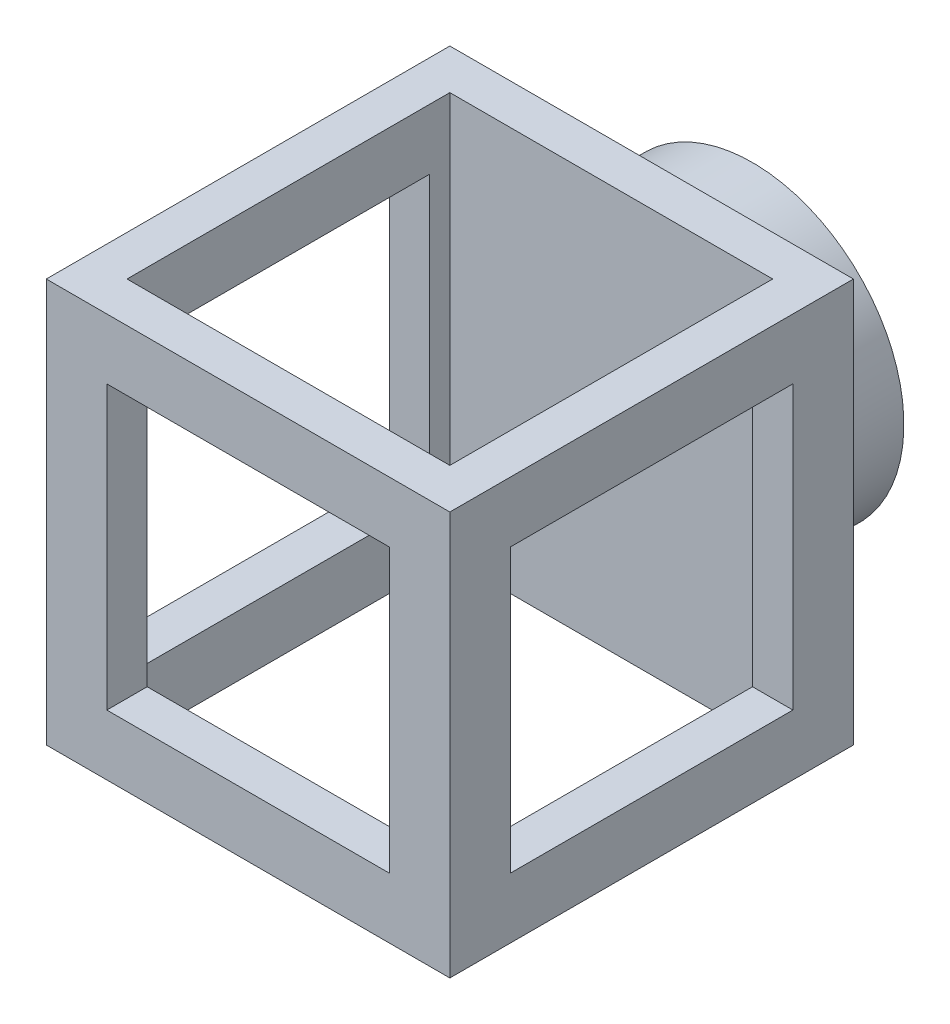
ISO-10303-21;
HEADER;
FILE_DESCRIPTION(('STEP AP214'),'2;1');
FILE_NAME('part.step','',(''),(''),'','','');
FILE_SCHEMA(('AUTOMOTIVE_DESIGN { 1 0 10303 214 1 1 1 1 }'));
ENDSEC;
DATA;
#1=APPLICATION_CONTEXT('core data for automotive mechanical design processes');
#2=APPLICATION_PROTOCOL_DEFINITION('international standard','automotive_design',2000,#1);
#3=PRODUCT_CONTEXT('',#1,'mechanical');
#4=PRODUCT('Part','Part','',(#3));
#5=PRODUCT_RELATED_PRODUCT_CATEGORY('part','',(#4));
#6=PRODUCT_DEFINITION_FORMATION('','',#4);
#7=PRODUCT_DEFINITION_CONTEXT('part definition',#1,'design');
#8=PRODUCT_DEFINITION('design','',#6,#7);
#9=PRODUCT_DEFINITION_SHAPE('','',#8);
#10=(LENGTH_UNIT() NAMED_UNIT(*) SI_UNIT(.MILLI.,.METRE.));
#11=(NAMED_UNIT(*) PLANE_ANGLE_UNIT() SI_UNIT($,.RADIAN.));
#12=(NAMED_UNIT(*) SI_UNIT($,.STERADIAN.) SOLID_ANGLE_UNIT());
#13=UNCERTAINTY_MEASURE_WITH_UNIT(LENGTH_MEASURE(1.E-05),#10,'distance_accuracy_value','');
#14=(GEOMETRIC_REPRESENTATION_CONTEXT(3) GLOBAL_UNCERTAINTY_ASSIGNED_CONTEXT((#13)) GLOBAL_UNIT_ASSIGNED_CONTEXT((#10,
#11,#12)) REPRESENTATION_CONTEXT('',''));
#15=CARTESIAN_POINT('',(0.,0.,0.));
#16=DIRECTION('',(0.,0.,1.));
#17=DIRECTION('',(1.,0.,0.));
#18=AXIS2_PLACEMENT_3D('',#15,#16,#17);
#19=CARTESIAN_POINT('',(0.,10.,0.));
#20=DIRECTION('',(0.,1.,0.));
#21=DIRECTION('',(0.,0.,1.));
#22=AXIS2_PLACEMENT_3D('',#19,#20,#21);
#23=PLANE('',#22);
#24=DIRECTION('',(0.,0.,-1.));
#25=VECTOR('',#24,1.);
#26=CARTESIAN_POINT('',(9.99999999999999,10.,-10.));
#27=LINE('',#26,#25);
#28=CARTESIAN_POINT('',(10.,10.,10.));
#29=VERTEX_POINT('',#28);
#30=CARTESIAN_POINT('',(9.99999999999999,10.,-10.));
#31=VERTEX_POINT('',#30);
#32=EDGE_CURVE('E292',#29,#31,#27,.T.);
#33=ORIENTED_EDGE('',*,*,#32,.T.);
#34=DIRECTION('',(-1.,0.,0.));
#35=VECTOR('',#34,1.);
#36=CARTESIAN_POINT('',(-10.,10.,-10.));
#37=LINE('',#36,#35);
#38=CARTESIAN_POINT('',(-10.,10.,-10.));
#39=VERTEX_POINT('',#38);
#40=EDGE_CURVE('E295',#31,#39,#37,.T.);
#41=ORIENTED_EDGE('',*,*,#40,.T.);
#42=DIRECTION('',(0.,0.,1.));
#43=VECTOR('',#42,1.);
#44=CARTESIAN_POINT('',(-10.,10.,-10.));
#45=LINE('',#44,#43);
#46=CARTESIAN_POINT('',(-10.,10.,10.));
#47=VERTEX_POINT('',#46);
#48=EDGE_CURVE('E298',#39,#47,#45,.T.);
#49=ORIENTED_EDGE('',*,*,#48,.T.);
#50=DIRECTION('',(1.,0.,0.));
#51=VECTOR('',#50,1.);
#52=CARTESIAN_POINT('',(-10.,10.,10.));
#53=LINE('',#52,#51);
#54=EDGE_CURVE('E300',#47,#29,#53,.T.);
#55=ORIENTED_EDGE('',*,*,#54,.T.);
#56=EDGE_LOOP('',(#33,#41,#49,#55));
#57=FACE_BOUND('',#56,.T.);
#58=DIRECTION('',(1.,0.,0.));
#59=VECTOR('',#58,1.);
#60=CARTESIAN_POINT('',(-8.00000000000001,10.,8.));
#61=LINE('',#60,#59);
#62=CARTESIAN_POINT('',(-8.00000000000001,10.,8.));
#63=VERTEX_POINT('',#62);
#64=CARTESIAN_POINT('',(7.99999999999999,10.,8.));
#65=VERTEX_POINT('',#64);
#66=EDGE_CURVE('E263',#63,#65,#61,.T.);
#67=ORIENTED_EDGE('',*,*,#66,.F.);
#68=DIRECTION('',(0.,0.,1.));
#69=VECTOR('',#68,1.);
#70=CARTESIAN_POINT('',(-8.00000000000001,10.,-8.));
#71=LINE('',#70,#69);
#72=CARTESIAN_POINT('',(-8.00000000000001,10.,-8.));
#73=VERTEX_POINT('',#72);
#74=EDGE_CURVE('E261',#73,#63,#71,.T.);
#75=ORIENTED_EDGE('',*,*,#74,.F.);
#76=DIRECTION('',(-1.,0.,0.));
#77=VECTOR('',#76,1.);
#78=CARTESIAN_POINT('',(-8.00000000000001,10.,-8.));
#79=LINE('',#78,#77);
#80=CARTESIAN_POINT('',(7.99999999999999,10.,-8.));
#81=VERTEX_POINT('',#80);
#82=EDGE_CURVE('E269',#81,#73,#79,.T.);
#83=ORIENTED_EDGE('',*,*,#82,.F.);
#84=DIRECTION('',(0.,0.,-1.));
#85=VECTOR('',#84,1.);
#86=CARTESIAN_POINT('',(7.99999999999999,10.,-8.));
#87=LINE('',#86,#85);
#88=EDGE_CURVE('E266',#65,#81,#87,.T.);
#89=ORIENTED_EDGE('',*,*,#88,.F.);
#90=EDGE_LOOP('',(#67,#75,#83,#89));
#91=FACE_BOUND('',#90,.T.);
#92=ADVANCED_FACE('F36',(#57,#91),#23,.T.);
#93=CARTESIAN_POINT('',(0.,-10.,0.));
#94=DIRECTION('',(0.,1.,0.));
#95=DIRECTION('',(0.,0.,1.));
#96=AXIS2_PLACEMENT_3D('',#93,#94,#95);
#97=PLANE('',#96);
#98=DIRECTION('',(0.,0.,-1.));
#99=VECTOR('',#98,1.);
#100=CARTESIAN_POINT('',(9.99999999999999,-10.,-10.));
#101=LINE('',#100,#99);
#102=CARTESIAN_POINT('',(10.,-10.,10.));
#103=VERTEX_POINT('',#102);
#104=CARTESIAN_POINT('',(9.99999999999999,-10.,-10.));
#105=VERTEX_POINT('',#104);
#106=EDGE_CURVE('E291',#103,#105,#101,.T.);
#107=ORIENTED_EDGE('',*,*,#106,.F.);
#108=DIRECTION('',(1.,0.,0.));
#109=VECTOR('',#108,1.);
#110=CARTESIAN_POINT('',(-10.,-10.,10.));
#111=LINE('',#110,#109);
#112=CARTESIAN_POINT('',(-10.,-10.,10.));
#113=VERTEX_POINT('',#112);
#114=EDGE_CURVE('E296',#113,#103,#111,.T.);
#115=ORIENTED_EDGE('',*,*,#114,.F.);
#116=DIRECTION('',(0.,0.,1.));
#117=VECTOR('',#116,1.);
#118=CARTESIAN_POINT('',(-10.,-10.,-10.));
#119=LINE('',#118,#117);
#120=CARTESIAN_POINT('',(-10.,-10.,-10.));
#121=VERTEX_POINT('',#120);
#122=EDGE_CURVE('E307',#121,#113,#119,.T.);
#123=ORIENTED_EDGE('',*,*,#122,.F.);
#124=DIRECTION('',(-1.,0.,0.));
#125=VECTOR('',#124,1.);
#126=CARTESIAN_POINT('',(-10.,-10.,-10.));
#127=LINE('',#126,#125);
#128=EDGE_CURVE('E305',#105,#121,#127,.T.);
#129=ORIENTED_EDGE('',*,*,#128,.F.);
#130=EDGE_LOOP('',(#107,#115,#123,#129));
#131=FACE_BOUND('',#130,.T.);
#132=DIRECTION('',(0.,0.,1.));
#133=VECTOR('',#132,1.);
#134=CARTESIAN_POINT('',(-8.00000000000001,-10.,-8.));
#135=LINE('',#134,#133);
#136=CARTESIAN_POINT('',(-8.00000000000001,-10.,-8.));
#137=VERTEX_POINT('',#136);
#138=CARTESIAN_POINT('',(-8.00000000000001,-10.,8.));
#139=VERTEX_POINT('',#138);
#140=EDGE_CURVE('E260',#137,#139,#135,.T.);
#141=ORIENTED_EDGE('',*,*,#140,.T.);
#142=DIRECTION('',(1.,0.,0.));
#143=VECTOR('',#142,1.);
#144=CARTESIAN_POINT('',(-8.00000000000001,-10.,8.));
#145=LINE('',#144,#143);
#146=CARTESIAN_POINT('',(7.99999999999999,-10.,8.));
#147=VERTEX_POINT('',#146);
#148=EDGE_CURVE('E274',#139,#147,#145,.T.);
#149=ORIENTED_EDGE('',*,*,#148,.T.);
#150=DIRECTION('',(0.,0.,-1.));
#151=VECTOR('',#150,1.);
#152=CARTESIAN_POINT('',(7.99999999999999,-10.,-8.));
#153=LINE('',#152,#151);
#154=CARTESIAN_POINT('',(7.99999999999999,-10.,-8.));
#155=VERTEX_POINT('',#154);
#156=EDGE_CURVE('E277',#147,#155,#153,.T.);
#157=ORIENTED_EDGE('',*,*,#156,.T.);
#158=DIRECTION('',(-1.,0.,0.));
#159=VECTOR('',#158,1.);
#160=CARTESIAN_POINT('',(-8.00000000000001,-10.,-8.));
#161=LINE('',#160,#159);
#162=EDGE_CURVE('E264',#155,#137,#161,.T.);
#163=ORIENTED_EDGE('',*,*,#162,.T.);
#164=EDGE_LOOP('',(#141,#149,#157,#163));
#165=FACE_BOUND('',#164,.T.);
#166=ADVANCED_FACE('F363',(#131,#165),#97,.F.);
#167=CARTESIAN_POINT('',(9.99999999999999,10.,-10.));
#168=DIRECTION('',(-1.,0.,0.));
#169=DIRECTION('',(0.,0.,1.));
#170=AXIS2_PLACEMENT_3D('',#167,#168,#169);
#171=PLANE('',#170);
#172=DIRECTION('',(0.,0.,-1.));
#173=VECTOR('',#172,1.);
#174=CARTESIAN_POINT('',(10.,-7.,7.));
#175=LINE('',#174,#173);
#176=CARTESIAN_POINT('',(10.,-7.,7.));
#177=VERTEX_POINT('',#176);
#178=CARTESIAN_POINT('',(9.99999999999999,-7.,-7.));
#179=VERTEX_POINT('',#178);
#180=EDGE_CURVE('E210',#177,#179,#175,.T.);
#181=ORIENTED_EDGE('',*,*,#180,.F.);
#182=DIRECTION('',(0.,-1.,0.));
#183=VECTOR('',#182,1.);
#184=CARTESIAN_POINT('',(10.,7.,7.));
#185=LINE('',#184,#183);
#186=CARTESIAN_POINT('',(10.,7.,7.));
#187=VERTEX_POINT('',#186);
#188=EDGE_CURVE('E52',#187,#177,#185,.T.);
#189=ORIENTED_EDGE('',*,*,#188,.F.);
#190=DIRECTION('',(0.,0.,1.));
#191=VECTOR('',#190,1.);
#192=CARTESIAN_POINT('',(9.99999999999999,7.,-7.));
#193=LINE('',#192,#191);
#194=CARTESIAN_POINT('',(9.99999999999999,7.,-7.));
#195=VERTEX_POINT('',#194);
#196=EDGE_CURVE('E200',#195,#187,#193,.T.);
#197=ORIENTED_EDGE('',*,*,#196,.F.);
#198=DIRECTION('',(0.,1.,0.));
#199=VECTOR('',#198,1.);
#200=CARTESIAN_POINT('',(9.99999999999999,-7.,-7.));
#201=LINE('',#200,#199);
#202=EDGE_CURVE('E203',#179,#195,#201,.T.);
#203=ORIENTED_EDGE('',*,*,#202,.F.);
#204=EDGE_LOOP('',(#181,#189,#197,#203));
#205=FACE_BOUND('',#204,.T.);
#206=ORIENTED_EDGE('',*,*,#106,.T.);
#207=DIRECTION('',(0.,-1.,0.));
#208=VECTOR('',#207,1.);
#209=CARTESIAN_POINT('',(9.99999999999999,10.,-10.));
#210=LINE('',#209,#208);
#211=EDGE_CURVE('E318',#31,#105,#210,.T.);
#212=ORIENTED_EDGE('',*,*,#211,.F.);
#213=ORIENTED_EDGE('',*,*,#32,.F.);
#214=DIRECTION('',(0.,-1.,0.));
#215=VECTOR('',#214,1.);
#216=CARTESIAN_POINT('',(10.,10.,10.));
#217=LINE('',#216,#215);
#218=EDGE_CURVE('E302',#29,#103,#217,.T.);
#219=ORIENTED_EDGE('',*,*,#218,.T.);
#220=EDGE_LOOP('',(#206,#212,#213,#219));
#221=FACE_BOUND('',#220,.T.);
#222=ADVANCED_FACE('F38',(#205,#221),#171,.F.);
#223=CARTESIAN_POINT('',(-10.,10.,-10.));
#224=DIRECTION('',(0.,0.,1.));
#225=DIRECTION('',(1.,0.,0.));
#226=AXIS2_PLACEMENT_3D('',#223,#224,#225);
#227=PLANE('',#226);
#228=CARTESIAN_POINT('',(0.,0.,-10.));
#229=DIRECTION('',(0.,0.,-1.));
#230=DIRECTION('',(-1.,0.,0.));
#231=AXIS2_PLACEMENT_3D('',#228,#229,#230);
#232=CIRCLE('',#231,7.5);
#233=CARTESIAN_POINT('',(-7.5,0.,-10.));
#234=VERTEX_POINT('',#233);
#235=EDGE_CURVE('E11',#234,#234,#232,.T.);
#236=ORIENTED_EDGE('',*,*,#235,.F.);
#237=EDGE_LOOP('',(#236));
#238=FACE_BOUND('',#237,.T.);
#239=ORIENTED_EDGE('',*,*,#128,.T.);
#240=DIRECTION('',(0.,-1.,0.));
#241=VECTOR('',#240,1.);
#242=CARTESIAN_POINT('',(-10.,10.,-10.));
#243=LINE('',#242,#241);
#244=EDGE_CURVE('E315',#39,#121,#243,.T.);
#245=ORIENTED_EDGE('',*,*,#244,.F.);
#246=ORIENTED_EDGE('',*,*,#40,.F.);
#247=ORIENTED_EDGE('',*,*,#211,.T.);
#248=EDGE_LOOP('',(#239,#245,#246,#247));
#249=FACE_BOUND('',#248,.T.);
#250=ADVANCED_FACE('F381',(#238,#249),#227,.F.);
#251=CARTESIAN_POINT('',(-10.,10.,-10.));
#252=DIRECTION('',(1.,0.,0.));
#253=DIRECTION('',(0.,0.,-1.));
#254=AXIS2_PLACEMENT_3D('',#251,#252,#253);
#255=PLANE('',#254);
#256=DIRECTION('',(0.,0.,1.));
#257=VECTOR('',#256,1.);
#258=CARTESIAN_POINT('',(-10.,7.,-7.));
#259=LINE('',#258,#257);
#260=CARTESIAN_POINT('',(-10.,7.,-7.));
#261=VERTEX_POINT('',#260);
#262=CARTESIAN_POINT('',(-10.,7.,7.));
#263=VERTEX_POINT('',#262);
#264=EDGE_CURVE('E199',#261,#263,#259,.T.);
#265=ORIENTED_EDGE('',*,*,#264,.T.);
#266=DIRECTION('',(0.,-1.,0.));
#267=VECTOR('',#266,1.);
#268=CARTESIAN_POINT('',(-10.,7.,7.));
#269=LINE('',#268,#267);
#270=CARTESIAN_POINT('',(-10.,-7.,7.));
#271=VERTEX_POINT('',#270);
#272=EDGE_CURVE('E181',#263,#271,#269,.T.);
#273=ORIENTED_EDGE('',*,*,#272,.T.);
#274=DIRECTION('',(0.,0.,-1.));
#275=VECTOR('',#274,1.);
#276=CARTESIAN_POINT('',(-10.,-7.,7.));
#277=LINE('',#276,#275);
#278=CARTESIAN_POINT('',(-10.,-7.,-7.));
#279=VERTEX_POINT('',#278);
#280=EDGE_CURVE('E191',#271,#279,#277,.T.);
#281=ORIENTED_EDGE('',*,*,#280,.T.);
#282=DIRECTION('',(0.,1.,0.));
#283=VECTOR('',#282,1.);
#284=CARTESIAN_POINT('',(-10.,-7.,-7.));
#285=LINE('',#284,#283);
#286=EDGE_CURVE('E60',#279,#261,#285,.T.);
#287=ORIENTED_EDGE('',*,*,#286,.T.);
#288=EDGE_LOOP('',(#265,#273,#281,#287));
#289=FACE_BOUND('',#288,.T.);
#290=ORIENTED_EDGE('',*,*,#122,.T.);
#291=DIRECTION('',(0.,-1.,0.));
#292=VECTOR('',#291,1.);
#293=CARTESIAN_POINT('',(-10.,10.,10.));
#294=LINE('',#293,#292);
#295=EDGE_CURVE('E312',#47,#113,#294,.T.);
#296=ORIENTED_EDGE('',*,*,#295,.F.);
#297=ORIENTED_EDGE('',*,*,#48,.F.);
#298=ORIENTED_EDGE('',*,*,#244,.T.);
#299=EDGE_LOOP('',(#290,#296,#297,#298));
#300=FACE_BOUND('',#299,.T.);
#301=ADVANCED_FACE('F196',(#289,#300),#255,.F.);
#302=CARTESIAN_POINT('',(-10.,10.,10.));
#303=DIRECTION('',(0.,0.,-1.));
#304=DIRECTION('',(-1.,0.,0.));
#305=AXIS2_PLACEMENT_3D('',#302,#303,#304);
#306=PLANE('',#305);
#307=DIRECTION('',(1.,0.,0.));
#308=VECTOR('',#307,1.);
#309=CARTESIAN_POINT('',(-7.,-7.,10.));
#310=LINE('',#309,#308);
#311=CARTESIAN_POINT('',(-7.,-7.,10.));
#312=VERTEX_POINT('',#311);
#313=CARTESIAN_POINT('',(7.,-7.,10.));
#314=VERTEX_POINT('',#313);
#315=EDGE_CURVE('E233',#312,#314,#310,.T.);
#316=ORIENTED_EDGE('',*,*,#315,.F.);
#317=DIRECTION('',(0.,-1.,0.));
#318=VECTOR('',#317,1.);
#319=CARTESIAN_POINT('',(-7.,7.,10.));
#320=LINE('',#319,#318);
#321=CARTESIAN_POINT('',(-7.,7.,10.));
#322=VERTEX_POINT('',#321);
#323=EDGE_CURVE('E231',#322,#312,#320,.T.);
#324=ORIENTED_EDGE('',*,*,#323,.F.);
#325=DIRECTION('',(-1.,0.,0.));
#326=VECTOR('',#325,1.);
#327=CARTESIAN_POINT('',(7.,7.,10.));
#328=LINE('',#327,#326);
#329=CARTESIAN_POINT('',(7.,7.,10.));
#330=VERTEX_POINT('',#329);
#331=EDGE_CURVE('E239',#330,#322,#328,.T.);
#332=ORIENTED_EDGE('',*,*,#331,.F.);
#333=DIRECTION('',(0.,1.,0.));
#334=VECTOR('',#333,1.);
#335=CARTESIAN_POINT('',(7.,-7.,10.));
#336=LINE('',#335,#334);
#337=EDGE_CURVE('E236',#314,#330,#336,.T.);
#338=ORIENTED_EDGE('',*,*,#337,.F.);
#339=EDGE_LOOP('',(#316,#324,#332,#338));
#340=FACE_BOUND('',#339,.T.);
#341=ORIENTED_EDGE('',*,*,#114,.T.);
#342=ORIENTED_EDGE('',*,*,#218,.F.);
#343=ORIENTED_EDGE('',*,*,#54,.F.);
#344=ORIENTED_EDGE('',*,*,#295,.T.);
#345=EDGE_LOOP('',(#341,#342,#343,#344));
#346=FACE_BOUND('',#345,.T.);
#347=ADVANCED_FACE('F376',(#340,#346),#306,.F.);
#348=CARTESIAN_POINT('',(-8.00000000000001,10.,-8.));
#349=DIRECTION('',(1.,0.,0.));
#350=DIRECTION('',(0.,0.,-1.));
#351=AXIS2_PLACEMENT_3D('',#348,#349,#350);
#352=PLANE('',#351);
#353=DIRECTION('',(0.,-1.,0.));
#354=VECTOR('',#353,1.);
#355=CARTESIAN_POINT('',(-8.00000000000001,10.,7.));
#356=LINE('',#355,#354);
#357=CARTESIAN_POINT('',(-8.00000000000001,7.,7.));
#358=VERTEX_POINT('',#357);
#359=CARTESIAN_POINT('',(-8.00000000000001,-7.,7.));
#360=VERTEX_POINT('',#359);
#361=EDGE_CURVE('E184',#358,#360,#356,.T.);
#362=ORIENTED_EDGE('',*,*,#361,.F.);
#363=DIRECTION('',(0.,0.,1.));
#364=VECTOR('',#363,1.);
#365=CARTESIAN_POINT('',(-8.00000000000001,7.,-8.));
#366=LINE('',#365,#364);
#367=CARTESIAN_POINT('',(-8.00000000000001,7.,-7.));
#368=VERTEX_POINT('',#367);
#369=EDGE_CURVE('E228',#368,#358,#366,.T.);
#370=ORIENTED_EDGE('',*,*,#369,.F.);
#371=DIRECTION('',(0.,1.,0.));
#372=VECTOR('',#371,1.);
#373=CARTESIAN_POINT('',(-8.00000000000001,10.,-7.));
#374=LINE('',#373,#372);
#375=CARTESIAN_POINT('',(-8.00000000000001,-7.,-7.));
#376=VERTEX_POINT('',#375);
#377=EDGE_CURVE('E226',#376,#368,#374,.T.);
#378=ORIENTED_EDGE('',*,*,#377,.F.);
#379=DIRECTION('',(0.,0.,-1.));
#380=VECTOR('',#379,1.);
#381=CARTESIAN_POINT('',(-8.00000000000001,-7.,-8.));
#382=LINE('',#381,#380);
#383=EDGE_CURVE('E218',#360,#376,#382,.T.);
#384=ORIENTED_EDGE('',*,*,#383,.F.);
#385=EDGE_LOOP('',(#362,#370,#378,#384));
#386=FACE_BOUND('',#385,.T.);
#387=ORIENTED_EDGE('',*,*,#140,.F.);
#388=DIRECTION('',(0.,-1.,0.));
#389=VECTOR('',#388,1.);
#390=CARTESIAN_POINT('',(-8.00000000000001,10.,-8.));
#391=LINE('',#390,#389);
#392=EDGE_CURVE('E271',#73,#137,#391,.T.);
#393=ORIENTED_EDGE('',*,*,#392,.F.);
#394=ORIENTED_EDGE('',*,*,#74,.T.);
#395=DIRECTION('',(0.,-1.,0.));
#396=VECTOR('',#395,1.);
#397=CARTESIAN_POINT('',(-8.00000000000001,10.,8.));
#398=LINE('',#397,#396);
#399=EDGE_CURVE('E288',#63,#139,#398,.T.);
#400=ORIENTED_EDGE('',*,*,#399,.T.);
#401=EDGE_LOOP('',(#387,#393,#394,#400));
#402=FACE_BOUND('',#401,.T.);
#403=ADVANCED_FACE('F373',(#386,#402),#352,.T.);
#404=CARTESIAN_POINT('',(-8.00000000000001,10.,8.));
#405=DIRECTION('',(0.,0.,-1.));
#406=DIRECTION('',(-1.,0.,0.));
#407=AXIS2_PLACEMENT_3D('',#404,#405,#406);
#408=PLANE('',#407);
#409=DIRECTION('',(0.,1.,0.));
#410=VECTOR('',#409,1.);
#411=CARTESIAN_POINT('',(-7.,10.,8.));
#412=LINE('',#411,#410);
#413=CARTESIAN_POINT('',(-7.,-7.,8.));
#414=VERTEX_POINT('',#413);
#415=CARTESIAN_POINT('',(-7.,7.,8.));
#416=VERTEX_POINT('',#415);
#417=EDGE_CURVE('E258',#414,#416,#412,.T.);
#418=ORIENTED_EDGE('',*,*,#417,.F.);
#419=DIRECTION('',(-1.,0.,0.));
#420=VECTOR('',#419,1.);
#421=CARTESIAN_POINT('',(-8.00000000000001,-7.,8.));
#422=LINE('',#421,#420);
#423=CARTESIAN_POINT('',(7.,-7.,8.));
#424=VERTEX_POINT('',#423);
#425=EDGE_CURVE('E245',#424,#414,#422,.T.);
#426=ORIENTED_EDGE('',*,*,#425,.F.);
#427=DIRECTION('',(0.,-1.,0.));
#428=VECTOR('',#427,1.);
#429=CARTESIAN_POINT('',(7.,10.,8.));
#430=LINE('',#429,#428);
#431=CARTESIAN_POINT('',(7.,7.,8.));
#432=VERTEX_POINT('',#431);
#433=EDGE_CURVE('E253',#432,#424,#430,.T.);
#434=ORIENTED_EDGE('',*,*,#433,.F.);
#435=DIRECTION('',(1.,0.,0.));
#436=VECTOR('',#435,1.);
#437=CARTESIAN_POINT('',(-8.00000000000001,7.,8.));
#438=LINE('',#437,#436);
#439=EDGE_CURVE('E256',#416,#432,#438,.T.);
#440=ORIENTED_EDGE('',*,*,#439,.F.);
#441=EDGE_LOOP('',(#418,#426,#434,#440));
#442=FACE_BOUND('',#441,.T.);
#443=ORIENTED_EDGE('',*,*,#148,.F.);
#444=ORIENTED_EDGE('',*,*,#399,.F.);
#445=ORIENTED_EDGE('',*,*,#66,.T.);
#446=DIRECTION('',(0.,-1.,0.));
#447=VECTOR('',#446,1.);
#448=CARTESIAN_POINT('',(7.99999999999999,10.,8.));
#449=LINE('',#448,#447);
#450=EDGE_CURVE('E286',#65,#147,#449,.T.);
#451=ORIENTED_EDGE('',*,*,#450,.T.);
#452=EDGE_LOOP('',(#443,#444,#445,#451));
#453=FACE_BOUND('',#452,.T.);
#454=ADVANCED_FACE('F412',(#442,#453),#408,.T.);
#455=CARTESIAN_POINT('',(7.99999999999999,10.,-8.));
#456=DIRECTION('',(-1.,0.,0.));
#457=DIRECTION('',(0.,0.,1.));
#458=AXIS2_PLACEMENT_3D('',#455,#456,#457);
#459=PLANE('',#458);
#460=DIRECTION('',(0.,1.,0.));
#461=VECTOR('',#460,1.);
#462=CARTESIAN_POINT('',(7.99999999999999,10.,7.));
#463=LINE('',#462,#461);
#464=CARTESIAN_POINT('',(8.,-7.,7.));
#465=VERTEX_POINT('',#464);
#466=CARTESIAN_POINT('',(8.,7.,7.));
#467=VERTEX_POINT('',#466);
#468=EDGE_CURVE('E40',#465,#467,#463,.T.);
#469=ORIENTED_EDGE('',*,*,#468,.F.);
#470=DIRECTION('',(0.,0.,1.));
#471=VECTOR('',#470,1.);
#472=CARTESIAN_POINT('',(7.99999999999999,-7.,-8.));
#473=LINE('',#472,#471);
#474=CARTESIAN_POINT('',(7.99999999999999,-7.,-7.));
#475=VERTEX_POINT('',#474);
#476=EDGE_CURVE('E321',#475,#465,#473,.T.);
#477=ORIENTED_EDGE('',*,*,#476,.F.);
#478=DIRECTION('',(0.,-1.,0.));
#479=VECTOR('',#478,1.);
#480=CARTESIAN_POINT('',(7.99999999999999,10.,-7.));
#481=LINE('',#480,#479);
#482=CARTESIAN_POINT('',(7.99999999999999,7.,-7.));
#483=VERTEX_POINT('',#482);
#484=EDGE_CURVE('E323',#483,#475,#481,.T.);
#485=ORIENTED_EDGE('',*,*,#484,.F.);
#486=DIRECTION('',(0.,0.,-1.));
#487=VECTOR('',#486,1.);
#488=CARTESIAN_POINT('',(7.99999999999999,7.,-8.));
#489=LINE('',#488,#487);
#490=EDGE_CURVE('E325',#467,#483,#489,.T.);
#491=ORIENTED_EDGE('',*,*,#490,.F.);
#492=EDGE_LOOP('',(#469,#477,#485,#491));
#493=FACE_BOUND('',#492,.T.);
#494=ORIENTED_EDGE('',*,*,#156,.F.);
#495=ORIENTED_EDGE('',*,*,#450,.F.);
#496=ORIENTED_EDGE('',*,*,#88,.T.);
#497=DIRECTION('',(0.,-1.,0.));
#498=VECTOR('',#497,1.);
#499=CARTESIAN_POINT('',(7.99999999999999,10.,-8.));
#500=LINE('',#499,#498);
#501=EDGE_CURVE('E284',#81,#155,#500,.T.);
#502=ORIENTED_EDGE('',*,*,#501,.T.);
#503=EDGE_LOOP('',(#494,#495,#496,#502));
#504=FACE_BOUND('',#503,.T.);
#505=ADVANCED_FACE('F337',(#493,#504),#459,.T.);
#506=CARTESIAN_POINT('',(-8.00000000000001,10.,-8.));
#507=DIRECTION('',(0.,0.,1.));
#508=DIRECTION('',(1.,0.,0.));
#509=AXIS2_PLACEMENT_3D('',#506,#507,#508);
#510=PLANE('',#509);
#511=ORIENTED_EDGE('',*,*,#162,.F.);
#512=ORIENTED_EDGE('',*,*,#501,.F.);
#513=ORIENTED_EDGE('',*,*,#82,.T.);
#514=ORIENTED_EDGE('',*,*,#392,.T.);
#515=EDGE_LOOP('',(#511,#512,#513,#514));
#516=FACE_BOUND('',#515,.T.);
#517=ADVANCED_FACE('F407',(#516),#510,.T.);
#518=CARTESIAN_POINT('',(-7.,7.,-10.));
#519=DIRECTION('',(-1.,0.,0.));
#520=DIRECTION('',(0.,0.,1.));
#521=AXIS2_PLACEMENT_3D('',#518,#519,#520);
#522=PLANE('',#521);
#523=ORIENTED_EDGE('',*,*,#417,.T.);
#524=DIRECTION('',(0.,0.,1.));
#525=VECTOR('',#524,1.);
#526=CARTESIAN_POINT('',(-7.,7.,-10.));
#527=LINE('',#526,#525);
#528=EDGE_CURVE('E243',#416,#322,#527,.T.);
#529=ORIENTED_EDGE('',*,*,#528,.T.);
#530=ORIENTED_EDGE('',*,*,#323,.T.);
#531=DIRECTION('',(0.,0.,1.));
#532=VECTOR('',#531,1.);
#533=CARTESIAN_POINT('',(-7.,-7.,-10.));
#534=LINE('',#533,#532);
#535=EDGE_CURVE('E242',#414,#312,#534,.T.);
#536=ORIENTED_EDGE('',*,*,#535,.F.);
#537=EDGE_LOOP('',(#523,#529,#530,#536));
#538=FACE_BOUND('',#537,.T.);
#539=ADVANCED_FACE('F421',(#538),#522,.F.);
#540=CARTESIAN_POINT('',(7.,7.,-10.));
#541=DIRECTION('',(0.,1.,0.));
#542=DIRECTION('',(0.,0.,1.));
#543=AXIS2_PLACEMENT_3D('',#540,#541,#542);
#544=PLANE('',#543);
#545=ORIENTED_EDGE('',*,*,#439,.T.);
#546=DIRECTION('',(0.,0.,1.));
#547=VECTOR('',#546,1.);
#548=CARTESIAN_POINT('',(7.,7.,-10.));
#549=LINE('',#548,#547);
#550=EDGE_CURVE('E246',#432,#330,#549,.T.);
#551=ORIENTED_EDGE('',*,*,#550,.T.);
#552=ORIENTED_EDGE('',*,*,#331,.T.);
#553=ORIENTED_EDGE('',*,*,#528,.F.);
#554=EDGE_LOOP('',(#545,#551,#552,#553));
#555=FACE_BOUND('',#554,.T.);
#556=ADVANCED_FACE('F426',(#555),#544,.F.);
#557=CARTESIAN_POINT('',(7.,-7.,-10.));
#558=DIRECTION('',(1.,0.,0.));
#559=DIRECTION('',(0.,0.,-1.));
#560=AXIS2_PLACEMENT_3D('',#557,#558,#559);
#561=PLANE('',#560);
#562=ORIENTED_EDGE('',*,*,#433,.T.);
#563=DIRECTION('',(0.,0.,1.));
#564=VECTOR('',#563,1.);
#565=CARTESIAN_POINT('',(7.,-7.,-10.));
#566=LINE('',#565,#564);
#567=EDGE_CURVE('E248',#424,#314,#566,.T.);
#568=ORIENTED_EDGE('',*,*,#567,.T.);
#569=ORIENTED_EDGE('',*,*,#337,.T.);
#570=ORIENTED_EDGE('',*,*,#550,.F.);
#571=EDGE_LOOP('',(#562,#568,#569,#570));
#572=FACE_BOUND('',#571,.T.);
#573=ADVANCED_FACE('F356',(#572),#561,.F.);
#574=CARTESIAN_POINT('',(-7.,-7.,-10.));
#575=DIRECTION('',(0.,-1.,0.));
#576=DIRECTION('',(0.,0.,-1.));
#577=AXIS2_PLACEMENT_3D('',#574,#575,#576);
#578=PLANE('',#577);
#579=ORIENTED_EDGE('',*,*,#425,.T.);
#580=ORIENTED_EDGE('',*,*,#535,.T.);
#581=ORIENTED_EDGE('',*,*,#315,.T.);
#582=ORIENTED_EDGE('',*,*,#567,.F.);
#583=EDGE_LOOP('',(#579,#580,#581,#582));
#584=FACE_BOUND('',#583,.T.);
#585=ADVANCED_FACE('F348',(#584),#578,.F.);
#586=CARTESIAN_POINT('',(-10.,-7.,7.));
#587=DIRECTION('',(0.,-1.,0.));
#588=DIRECTION('',(0.,0.,-1.));
#589=AXIS2_PLACEMENT_3D('',#586,#587,#588);
#590=PLANE('',#589);
#591=ORIENTED_EDGE('',*,*,#476,.T.);
#592=DIRECTION('',(1.,0.,0.));
#593=VECTOR('',#592,1.);
#594=CARTESIAN_POINT('',(-10.,-7.,7.));
#595=LINE('',#594,#593);
#596=EDGE_CURVE('E188',#465,#177,#595,.T.);
#597=ORIENTED_EDGE('',*,*,#596,.T.);
#598=ORIENTED_EDGE('',*,*,#180,.T.);
#599=DIRECTION('',(1.,0.,0.));
#600=VECTOR('',#599,1.);
#601=CARTESIAN_POINT('',(-10.,-7.,-7.));
#602=LINE('',#601,#600);
#603=EDGE_CURVE('E187',#475,#179,#602,.T.);
#604=ORIENTED_EDGE('',*,*,#603,.F.);
#605=EDGE_LOOP('',(#591,#597,#598,#604));
#606=FACE_BOUND('',#605,.T.);
#607=ADVANCED_FACE('F346',(#606),#590,.F.);
#608=CARTESIAN_POINT('',(-10.,-7.,-7.));
#609=DIRECTION('',(0.,0.,-1.));
#610=DIRECTION('',(-1.,0.,0.));
#611=AXIS2_PLACEMENT_3D('',#608,#609,#610);
#612=PLANE('',#611);
#613=ORIENTED_EDGE('',*,*,#484,.T.);
#614=ORIENTED_EDGE('',*,*,#603,.T.);
#615=ORIENTED_EDGE('',*,*,#202,.T.);
#616=DIRECTION('',(1.,0.,0.));
#617=VECTOR('',#616,1.);
#618=CARTESIAN_POINT('',(-10.,7.,-7.));
#619=LINE('',#618,#617);
#620=EDGE_CURVE('E223',#483,#195,#619,.T.);
#621=ORIENTED_EDGE('',*,*,#620,.F.);
#622=EDGE_LOOP('',(#613,#614,#615,#621));
#623=FACE_BOUND('',#622,.T.);
#624=ADVANCED_FACE('F340',(#623),#612,.F.);
#625=CARTESIAN_POINT('',(-10.,7.,-7.));
#626=DIRECTION('',(0.,1.,0.));
#627=DIRECTION('',(0.,0.,1.));
#628=AXIS2_PLACEMENT_3D('',#625,#626,#627);
#629=PLANE('',#628);
#630=ORIENTED_EDGE('',*,*,#490,.T.);
#631=ORIENTED_EDGE('',*,*,#620,.T.);
#632=ORIENTED_EDGE('',*,*,#196,.T.);
#633=DIRECTION('',(1.,0.,0.));
#634=VECTOR('',#633,1.);
#635=CARTESIAN_POINT('',(-10.,7.,7.));
#636=LINE('',#635,#634);
#637=EDGE_CURVE('E219',#467,#187,#636,.T.);
#638=ORIENTED_EDGE('',*,*,#637,.F.);
#639=EDGE_LOOP('',(#630,#631,#632,#638));
#640=FACE_BOUND('',#639,.T.);
#641=ADVANCED_FACE('F334',(#640),#629,.F.);
#642=CARTESIAN_POINT('',(-10.,7.,7.));
#643=DIRECTION('',(0.,0.,1.));
#644=DIRECTION('',(1.,0.,0.));
#645=AXIS2_PLACEMENT_3D('',#642,#643,#644);
#646=PLANE('',#645);
#647=ORIENTED_EDGE('',*,*,#468,.T.);
#648=ORIENTED_EDGE('',*,*,#637,.T.);
#649=ORIENTED_EDGE('',*,*,#188,.T.);
#650=ORIENTED_EDGE('',*,*,#596,.F.);
#651=EDGE_LOOP('',(#647,#648,#649,#650));
#652=FACE_BOUND('',#651,.T.);
#653=ADVANCED_FACE('F331',(#652),#646,.F.);
#654=ORIENTED_EDGE('',*,*,#361,.T.);
#655=EDGE_CURVE('E176',#271,#360,#595,.T.);
#656=ORIENTED_EDGE('',*,*,#655,.F.);
#657=ORIENTED_EDGE('',*,*,#272,.F.);
#658=EDGE_CURVE('E216',#263,#358,#636,.T.);
#659=ORIENTED_EDGE('',*,*,#658,.T.);
#660=EDGE_LOOP('',(#654,#656,#657,#659));
#661=FACE_BOUND('',#660,.T.);
#662=ADVANCED_FACE('F178',(#661),#646,.F.);
#663=ORIENTED_EDGE('',*,*,#369,.T.);
#664=ORIENTED_EDGE('',*,*,#658,.F.);
#665=ORIENTED_EDGE('',*,*,#264,.F.);
#666=EDGE_CURVE('E220',#261,#368,#619,.T.);
#667=ORIENTED_EDGE('',*,*,#666,.T.);
#668=EDGE_LOOP('',(#663,#664,#665,#667));
#669=FACE_BOUND('',#668,.T.);
#670=ADVANCED_FACE('F439',(#669),#629,.F.);
#671=ORIENTED_EDGE('',*,*,#377,.T.);
#672=ORIENTED_EDGE('',*,*,#666,.F.);
#673=ORIENTED_EDGE('',*,*,#286,.F.);
#674=EDGE_CURVE('E193',#279,#376,#602,.T.);
#675=ORIENTED_EDGE('',*,*,#674,.T.);
#676=EDGE_LOOP('',(#671,#672,#673,#675));
#677=FACE_BOUND('',#676,.T.);
#678=ADVANCED_FACE('F355',(#677),#612,.F.);
#679=ORIENTED_EDGE('',*,*,#383,.T.);
#680=ORIENTED_EDGE('',*,*,#674,.F.);
#681=ORIENTED_EDGE('',*,*,#280,.F.);
#682=ORIENTED_EDGE('',*,*,#655,.T.);
#683=EDGE_LOOP('',(#679,#680,#681,#682));
#684=FACE_BOUND('',#683,.T.);
#685=ADVANCED_FACE('F192',(#684),#590,.F.);
#686=CARTESIAN_POINT('',(0.,0.,-15.));
#687=DIRECTION('',(0.,0.,1.));
#688=DIRECTION('',(1.,0.,0.));
#689=AXIS2_PLACEMENT_3D('',#686,#687,#688);
#690=CYLINDRICAL_SURFACE('',#689,7.5);
#691=CARTESIAN_POINT('',(0.,0.,-15.));
#692=DIRECTION('',(0.,0.,-1.));
#693=DIRECTION('',(-1.,0.,0.));
#694=AXIS2_PLACEMENT_3D('',#691,#692,#693);
#695=CIRCLE('',#694,7.5);
#696=CARTESIAN_POINT('',(-7.5,0.,-15.));
#697=VERTEX_POINT('',#696);
#698=EDGE_CURVE('E211',#697,#697,#695,.T.);
#699=ORIENTED_EDGE('',*,*,#698,.F.);
#700=EDGE_LOOP('',(#699));
#701=FACE_BOUND('',#700,.T.);
#702=ORIENTED_EDGE('',*,*,#235,.T.);
#703=EDGE_LOOP('',(#702));
#704=FACE_BOUND('',#703,.T.);
#705=ADVANCED_FACE('F361',(#701,#704),#690,.T.);
#706=CARTESIAN_POINT('',(0.,0.,-15.));
#707=DIRECTION('',(0.,0.,-1.));
#708=DIRECTION('',(-1.,0.,0.));
#709=AXIS2_PLACEMENT_3D('',#706,#707,#708);
#710=PLANE('',#709);
#711=ORIENTED_EDGE('',*,*,#698,.T.);
#712=EDGE_LOOP('',(#711));
#713=FACE_BOUND('',#712,.T.);
#714=ADVANCED_FACE('F537',(#713),#710,.T.);
#715=CLOSED_SHELL('',(#92,#166,#222,#250,#301,#347,#403,#454,#505,#517,#539,#556,#573,#585,#607,
#624,#641,#653,#662,#670,#678,#685,#705,#714));
#716=MANIFOLD_SOLID_BREP('B2',#715);
#717=ADVANCED_BREP_SHAPE_REPRESENTATION('',(#18,#716),#14);
#718=SHAPE_DEFINITION_REPRESENTATION(#9,#717);
ENDSEC;
END-ISO-10303-21;
